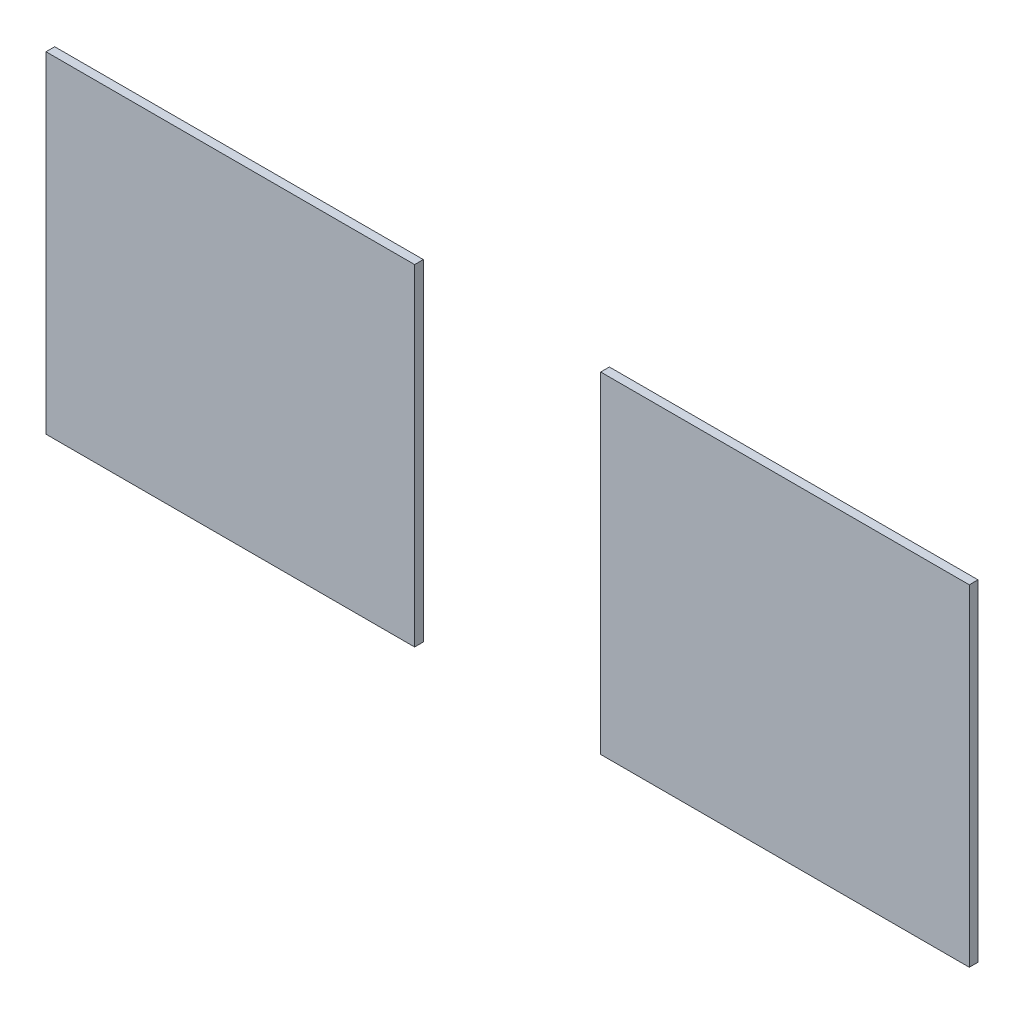
ISO-10303-21;
HEADER;
FILE_DESCRIPTION(('STEP AP214'),'2;1');
FILE_NAME('part.step','',(''),(''),'','','');
FILE_SCHEMA(('AUTOMOTIVE_DESIGN { 1 0 10303 214 1 1 1 1 }'));
ENDSEC;
DATA;
#1=APPLICATION_CONTEXT('core data for automotive mechanical design processes');
#2=APPLICATION_PROTOCOL_DEFINITION('international standard','automotive_design',2000,#1);
#3=PRODUCT_CONTEXT('',#1,'mechanical');
#4=PRODUCT('Part','Part','',(#3));
#5=PRODUCT_RELATED_PRODUCT_CATEGORY('part','',(#4));
#6=PRODUCT_DEFINITION_FORMATION('','',#4);
#7=PRODUCT_DEFINITION_CONTEXT('part definition',#1,'design');
#8=PRODUCT_DEFINITION('design','',#6,#7);
#9=PRODUCT_DEFINITION_SHAPE('','',#8);
#10=(LENGTH_UNIT() NAMED_UNIT(*) SI_UNIT(.MILLI.,.METRE.));
#11=(NAMED_UNIT(*) PLANE_ANGLE_UNIT() SI_UNIT($,.RADIAN.));
#12=(NAMED_UNIT(*) SI_UNIT($,.STERADIAN.) SOLID_ANGLE_UNIT());
#13=UNCERTAINTY_MEASURE_WITH_UNIT(LENGTH_MEASURE(1.E-05),#10,'distance_accuracy_value','');
#14=(GEOMETRIC_REPRESENTATION_CONTEXT(3) GLOBAL_UNCERTAINTY_ASSIGNED_CONTEXT((#13)) GLOBAL_UNIT_ASSIGNED_CONTEXT((#10,
#11,#12)) REPRESENTATION_CONTEXT('',''));
#15=CARTESIAN_POINT('',(0.,0.,0.));
#16=DIRECTION('',(0.,0.,1.));
#17=DIRECTION('',(1.,0.,0.));
#18=AXIS2_PLACEMENT_3D('',#15,#16,#17);
#19=CARTESIAN_POINT('',(10.62,3.81,0.1));
#20=DIRECTION('',(-1.,0.,0.));
#21=DIRECTION('',(0.,0.,1.));
#22=AXIS2_PLACEMENT_3D('',#19,#20,#21);
#23=PLANE('',#22);
#24=DIRECTION('',(0.,1.,0.));
#25=VECTOR('',#24,1.);
#26=CARTESIAN_POINT('',(10.62,3.81,0.));
#27=LINE('',#26,#25);
#28=CARTESIAN_POINT('',(10.62,0.,0.));
#29=VERTEX_POINT('',#28);
#30=CARTESIAN_POINT('',(10.62,3.81,0.));
#31=VERTEX_POINT('',#30);
#32=EDGE_CURVE('E106',#29,#31,#27,.T.);
#33=ORIENTED_EDGE('',*,*,#32,.T.);
#34=DIRECTION('',(0.,0.,-1.));
#35=VECTOR('',#34,1.);
#36=CARTESIAN_POINT('',(10.62,3.81,0.1));
#37=LINE('',#36,#35);
#38=CARTESIAN_POINT('',(10.62,3.81,0.1));
#39=VERTEX_POINT('',#38);
#40=EDGE_CURVE('E12',#39,#31,#37,.T.);
#41=ORIENTED_EDGE('',*,*,#40,.F.);
#42=DIRECTION('',(0.,1.,0.));
#43=VECTOR('',#42,1.);
#44=CARTESIAN_POINT('',(10.62,3.81,0.1));
#45=LINE('',#44,#43);
#46=CARTESIAN_POINT('',(10.62,0.,0.1));
#47=VERTEX_POINT('',#46);
#48=EDGE_CURVE('E94',#47,#39,#45,.T.);
#49=ORIENTED_EDGE('',*,*,#48,.F.);
#50=DIRECTION('',(0.,0.,-1.));
#51=VECTOR('',#50,1.);
#52=CARTESIAN_POINT('',(10.62,0.,0.1));
#53=LINE('',#52,#51);
#54=EDGE_CURVE('E102',#47,#29,#53,.T.);
#55=ORIENTED_EDGE('',*,*,#54,.T.);
#56=EDGE_LOOP('',(#33,#41,#49,#55));
#57=FACE_BOUND('',#56,.T.);
#58=ADVANCED_FACE('F43',(#57),#23,.F.);
#59=CARTESIAN_POINT('',(10.62,3.81,0.1));
#60=DIRECTION('',(0.,-1.,0.));
#61=DIRECTION('',(1.,0.,0.));
#62=AXIS2_PLACEMENT_3D('',#59,#60,#61);
#63=PLANE('',#62);
#64=DIRECTION('',(-1.,0.,0.));
#65=VECTOR('',#64,1.);
#66=CARTESIAN_POINT('',(10.62,3.81,0.));
#67=LINE('',#66,#65);
#68=CARTESIAN_POINT('',(6.38,3.81,0.));
#69=VERTEX_POINT('',#68);
#70=EDGE_CURVE('E98',#31,#69,#67,.T.);
#71=ORIENTED_EDGE('',*,*,#70,.T.);
#72=DIRECTION('',(0.,0.,-1.));
#73=VECTOR('',#72,1.);
#74=CARTESIAN_POINT('',(6.38,3.81,0.1));
#75=LINE('',#74,#73);
#76=CARTESIAN_POINT('',(6.38,3.81,0.1));
#77=VERTEX_POINT('',#76);
#78=EDGE_CURVE('E51',#77,#69,#75,.T.);
#79=ORIENTED_EDGE('',*,*,#78,.F.);
#80=DIRECTION('',(-1.,0.,0.));
#81=VECTOR('',#80,1.);
#82=CARTESIAN_POINT('',(10.62,3.81,0.1));
#83=LINE('',#82,#81);
#84=EDGE_CURVE('E89',#39,#77,#83,.T.);
#85=ORIENTED_EDGE('',*,*,#84,.F.);
#86=ORIENTED_EDGE('',*,*,#40,.T.);
#87=EDGE_LOOP('',(#71,#79,#85,#86));
#88=FACE_BOUND('',#87,.T.);
#89=ADVANCED_FACE('F97',(#88),#63,.F.);
#90=CARTESIAN_POINT('',(6.38,3.81,0.1));
#91=DIRECTION('',(1.,0.,0.));
#92=DIRECTION('',(0.,0.,-1.));
#93=AXIS2_PLACEMENT_3D('',#90,#91,#92);
#94=PLANE('',#93);
#95=DIRECTION('',(0.,-1.,0.));
#96=VECTOR('',#95,1.);
#97=CARTESIAN_POINT('',(6.38,3.81,0.));
#98=LINE('',#97,#96);
#99=CARTESIAN_POINT('',(6.38,0.,0.));
#100=VERTEX_POINT('',#99);
#101=EDGE_CURVE('E76',#69,#100,#98,.T.);
#102=ORIENTED_EDGE('',*,*,#101,.T.);
#103=DIRECTION('',(0.,0.,-1.));
#104=VECTOR('',#103,1.);
#105=CARTESIAN_POINT('',(6.38,0.,0.1));
#106=LINE('',#105,#104);
#107=CARTESIAN_POINT('',(6.38,0.,0.1));
#108=VERTEX_POINT('',#107);
#109=EDGE_CURVE('E99',#108,#100,#106,.T.);
#110=ORIENTED_EDGE('',*,*,#109,.F.);
#111=DIRECTION('',(0.,-1.,0.));
#112=VECTOR('',#111,1.);
#113=CARTESIAN_POINT('',(6.38,3.81,0.1));
#114=LINE('',#113,#112);
#115=EDGE_CURVE('E92',#77,#108,#114,.T.);
#116=ORIENTED_EDGE('',*,*,#115,.F.);
#117=ORIENTED_EDGE('',*,*,#78,.T.);
#118=EDGE_LOOP('',(#102,#110,#116,#117));
#119=FACE_BOUND('',#118,.T.);
#120=ADVANCED_FACE('F100',(#119),#94,.F.);
#121=CARTESIAN_POINT('',(10.62,0.,0.1));
#122=DIRECTION('',(0.,1.,0.));
#123=DIRECTION('',(0.,0.,1.));
#124=AXIS2_PLACEMENT_3D('',#121,#122,#123);
#125=PLANE('',#124);
#126=DIRECTION('',(1.,0.,0.));
#127=VECTOR('',#126,1.);
#128=CARTESIAN_POINT('',(10.62,0.,0.));
#129=LINE('',#128,#127);
#130=EDGE_CURVE('E82',#100,#29,#129,.T.);
#131=ORIENTED_EDGE('',*,*,#130,.T.);
#132=ORIENTED_EDGE('',*,*,#54,.F.);
#133=DIRECTION('',(1.,0.,0.));
#134=VECTOR('',#133,1.);
#135=CARTESIAN_POINT('',(10.62,0.,0.1));
#136=LINE('',#135,#134);
#137=EDGE_CURVE('E59',#108,#47,#136,.T.);
#138=ORIENTED_EDGE('',*,*,#137,.F.);
#139=ORIENTED_EDGE('',*,*,#109,.T.);
#140=EDGE_LOOP('',(#131,#132,#138,#139));
#141=FACE_BOUND('',#140,.T.);
#142=ADVANCED_FACE('F113',(#141),#125,.F.);
#143=CARTESIAN_POINT('',(0.,0.,0.1));
#144=DIRECTION('',(0.,0.,-1.));
#145=DIRECTION('',(-1.,0.,0.));
#146=AXIS2_PLACEMENT_3D('',#143,#144,#145);
#147=PLANE('',#146);
#148=ORIENTED_EDGE('',*,*,#48,.T.);
#149=ORIENTED_EDGE('',*,*,#84,.T.);
#150=ORIENTED_EDGE('',*,*,#115,.T.);
#151=ORIENTED_EDGE('',*,*,#137,.T.);
#152=EDGE_LOOP('',(#148,#149,#150,#151));
#153=FACE_BOUND('',#152,.T.);
#154=ADVANCED_FACE('F90',(#153),#147,.F.);
#155=CARTESIAN_POINT('',(0.,0.,0.));
#156=DIRECTION('',(0.,0.,-1.));
#157=DIRECTION('',(-1.,0.,0.));
#158=AXIS2_PLACEMENT_3D('',#155,#156,#157);
#159=PLANE('',#158);
#160=ORIENTED_EDGE('',*,*,#32,.F.);
#161=ORIENTED_EDGE('',*,*,#130,.F.);
#162=ORIENTED_EDGE('',*,*,#101,.F.);
#163=ORIENTED_EDGE('',*,*,#70,.F.);
#164=EDGE_LOOP('',(#160,#161,#162,#163));
#165=FACE_BOUND('',#164,.T.);
#166=ADVANCED_FACE('F116',(#165),#159,.T.);
#167=CLOSED_SHELL('',(#58,#89,#120,#142,#154,#166));
#168=MANIFOLD_SOLID_BREP('B2',#167);
#169=CARTESIAN_POINT('',(0.,0.,0.1));
#170=DIRECTION('',(1.,0.,0.));
#171=DIRECTION('',(0.,0.,-1.));
#172=AXIS2_PLACEMENT_3D('',#169,#170,#171);
#173=PLANE('',#172);
#174=DIRECTION('',(0.,-1.,0.));
#175=VECTOR('',#174,1.);
#176=CARTESIAN_POINT('',(0.,0.,0.));
#177=LINE('',#176,#175);
#178=CARTESIAN_POINT('',(0.,3.81,0.));
#179=VERTEX_POINT('',#178);
#180=CARTESIAN_POINT('',(0.,0.,0.));
#181=VERTEX_POINT('',#180);
#182=EDGE_CURVE('E230',#179,#181,#177,.T.);
#183=ORIENTED_EDGE('',*,*,#182,.T.);
#184=DIRECTION('',(0.,0.,-1.));
#185=VECTOR('',#184,1.);
#186=CARTESIAN_POINT('',(0.,0.,0.1));
#187=LINE('',#186,#185);
#188=CARTESIAN_POINT('',(0.,0.,0.1));
#189=VERTEX_POINT('',#188);
#190=EDGE_CURVE('E41',#189,#181,#187,.T.);
#191=ORIENTED_EDGE('',*,*,#190,.F.);
#192=DIRECTION('',(0.,-1.,0.));
#193=VECTOR('',#192,1.);
#194=CARTESIAN_POINT('',(0.,0.,0.1));
#195=LINE('',#194,#193);
#196=CARTESIAN_POINT('',(0.,3.81,0.1));
#197=VERTEX_POINT('',#196);
#198=EDGE_CURVE('E218',#197,#189,#195,.T.);
#199=ORIENTED_EDGE('',*,*,#198,.F.);
#200=DIRECTION('',(0.,0.,-1.));
#201=VECTOR('',#200,1.);
#202=CARTESIAN_POINT('',(0.,3.81,0.1));
#203=LINE('',#202,#201);
#204=EDGE_CURVE('E226',#197,#179,#203,.T.);
#205=ORIENTED_EDGE('',*,*,#204,.T.);
#206=EDGE_LOOP('',(#183,#191,#199,#205));
#207=FACE_BOUND('',#206,.T.);
#208=ADVANCED_FACE('F167',(#207),#173,.F.);
#209=CARTESIAN_POINT('',(0.,0.,0.1));
#210=DIRECTION('',(0.,1.,0.));
#211=DIRECTION('',(0.,0.,1.));
#212=AXIS2_PLACEMENT_3D('',#209,#210,#211);
#213=PLANE('',#212);
#214=DIRECTION('',(1.,0.,0.));
#215=VECTOR('',#214,1.);
#216=CARTESIAN_POINT('',(0.,0.,0.));
#217=LINE('',#216,#215);
#218=CARTESIAN_POINT('',(4.24,0.,0.));
#219=VERTEX_POINT('',#218);
#220=EDGE_CURVE('E222',#181,#219,#217,.T.);
#221=ORIENTED_EDGE('',*,*,#220,.T.);
#222=DIRECTION('',(0.,0.,-1.));
#223=VECTOR('',#222,1.);
#224=CARTESIAN_POINT('',(4.24,0.,0.1));
#225=LINE('',#224,#223);
#226=CARTESIAN_POINT('',(4.24,0.,0.1));
#227=VERTEX_POINT('',#226);
#228=EDGE_CURVE('E175',#227,#219,#225,.T.);
#229=ORIENTED_EDGE('',*,*,#228,.F.);
#230=DIRECTION('',(1.,0.,0.));
#231=VECTOR('',#230,1.);
#232=CARTESIAN_POINT('',(0.,0.,0.1));
#233=LINE('',#232,#231);
#234=EDGE_CURVE('E213',#189,#227,#233,.T.);
#235=ORIENTED_EDGE('',*,*,#234,.F.);
#236=ORIENTED_EDGE('',*,*,#190,.T.);
#237=EDGE_LOOP('',(#221,#229,#235,#236));
#238=FACE_BOUND('',#237,.T.);
#239=ADVANCED_FACE('F221',(#238),#213,.F.);
#240=CARTESIAN_POINT('',(4.24,0.,0.1));
#241=DIRECTION('',(-1.,0.,0.));
#242=DIRECTION('',(0.,0.,1.));
#243=AXIS2_PLACEMENT_3D('',#240,#241,#242);
#244=PLANE('',#243);
#245=DIRECTION('',(0.,1.,0.));
#246=VECTOR('',#245,1.);
#247=CARTESIAN_POINT('',(4.24,0.,0.));
#248=LINE('',#247,#246);
#249=CARTESIAN_POINT('',(4.24,3.81,0.));
#250=VERTEX_POINT('',#249);
#251=EDGE_CURVE('E200',#219,#250,#248,.T.);
#252=ORIENTED_EDGE('',*,*,#251,.T.);
#253=DIRECTION('',(0.,0.,-1.));
#254=VECTOR('',#253,1.);
#255=CARTESIAN_POINT('',(4.24,3.81,0.1));
#256=LINE('',#255,#254);
#257=CARTESIAN_POINT('',(4.24,3.81,0.1));
#258=VERTEX_POINT('',#257);
#259=EDGE_CURVE('E223',#258,#250,#256,.T.);
#260=ORIENTED_EDGE('',*,*,#259,.F.);
#261=DIRECTION('',(0.,1.,0.));
#262=VECTOR('',#261,1.);
#263=CARTESIAN_POINT('',(4.24,0.,0.1));
#264=LINE('',#263,#262);
#265=EDGE_CURVE('E216',#227,#258,#264,.T.);
#266=ORIENTED_EDGE('',*,*,#265,.F.);
#267=ORIENTED_EDGE('',*,*,#228,.T.);
#268=EDGE_LOOP('',(#252,#260,#266,#267));
#269=FACE_BOUND('',#268,.T.);
#270=ADVANCED_FACE('F224',(#269),#244,.F.);
#271=CARTESIAN_POINT('',(0.,3.81,0.1));
#272=DIRECTION('',(0.,-1.,0.));
#273=DIRECTION('',(0.,0.,-1.));
#274=AXIS2_PLACEMENT_3D('',#271,#272,#273);
#275=PLANE('',#274);
#276=DIRECTION('',(-1.,0.,0.));
#277=VECTOR('',#276,1.);
#278=CARTESIAN_POINT('',(0.,3.81,0.));
#279=LINE('',#278,#277);
#280=EDGE_CURVE('E206',#250,#179,#279,.T.);
#281=ORIENTED_EDGE('',*,*,#280,.T.);
#282=ORIENTED_EDGE('',*,*,#204,.F.);
#283=DIRECTION('',(-1.,0.,0.));
#284=VECTOR('',#283,1.);
#285=CARTESIAN_POINT('',(0.,3.81,0.1));
#286=LINE('',#285,#284);
#287=EDGE_CURVE('E183',#258,#197,#286,.T.);
#288=ORIENTED_EDGE('',*,*,#287,.F.);
#289=ORIENTED_EDGE('',*,*,#259,.T.);
#290=EDGE_LOOP('',(#281,#282,#288,#289));
#291=FACE_BOUND('',#290,.T.);
#292=ADVANCED_FACE('F237',(#291),#275,.F.);
#293=CARTESIAN_POINT('',(0.,0.,0.1));
#294=DIRECTION('',(0.,0.,-1.));
#295=DIRECTION('',(-1.,0.,0.));
#296=AXIS2_PLACEMENT_3D('',#293,#294,#295);
#297=PLANE('',#296);
#298=ORIENTED_EDGE('',*,*,#198,.T.);
#299=ORIENTED_EDGE('',*,*,#234,.T.);
#300=ORIENTED_EDGE('',*,*,#265,.T.);
#301=ORIENTED_EDGE('',*,*,#287,.T.);
#302=EDGE_LOOP('',(#298,#299,#300,#301));
#303=FACE_BOUND('',#302,.T.);
#304=ADVANCED_FACE('F214',(#303),#297,.F.);
#305=CARTESIAN_POINT('',(0.,0.,0.));
#306=DIRECTION('',(0.,0.,-1.));
#307=DIRECTION('',(-1.,0.,0.));
#308=AXIS2_PLACEMENT_3D('',#305,#306,#307);
#309=PLANE('',#308);
#310=ORIENTED_EDGE('',*,*,#182,.F.);
#311=ORIENTED_EDGE('',*,*,#280,.F.);
#312=ORIENTED_EDGE('',*,*,#251,.F.);
#313=ORIENTED_EDGE('',*,*,#220,.F.);
#314=EDGE_LOOP('',(#310,#311,#312,#313));
#315=FACE_BOUND('',#314,.T.);
#316=ADVANCED_FACE('F240',(#315),#309,.T.);
#317=CLOSED_SHELL('',(#208,#239,#270,#292,#304,#316));
#318=MANIFOLD_SOLID_BREP('B6',#317);
#319=ADVANCED_BREP_SHAPE_REPRESENTATION('',(#18,#168,#318),#14);
#320=SHAPE_DEFINITION_REPRESENTATION(#9,#319);
ENDSEC;
END-ISO-10303-21;
